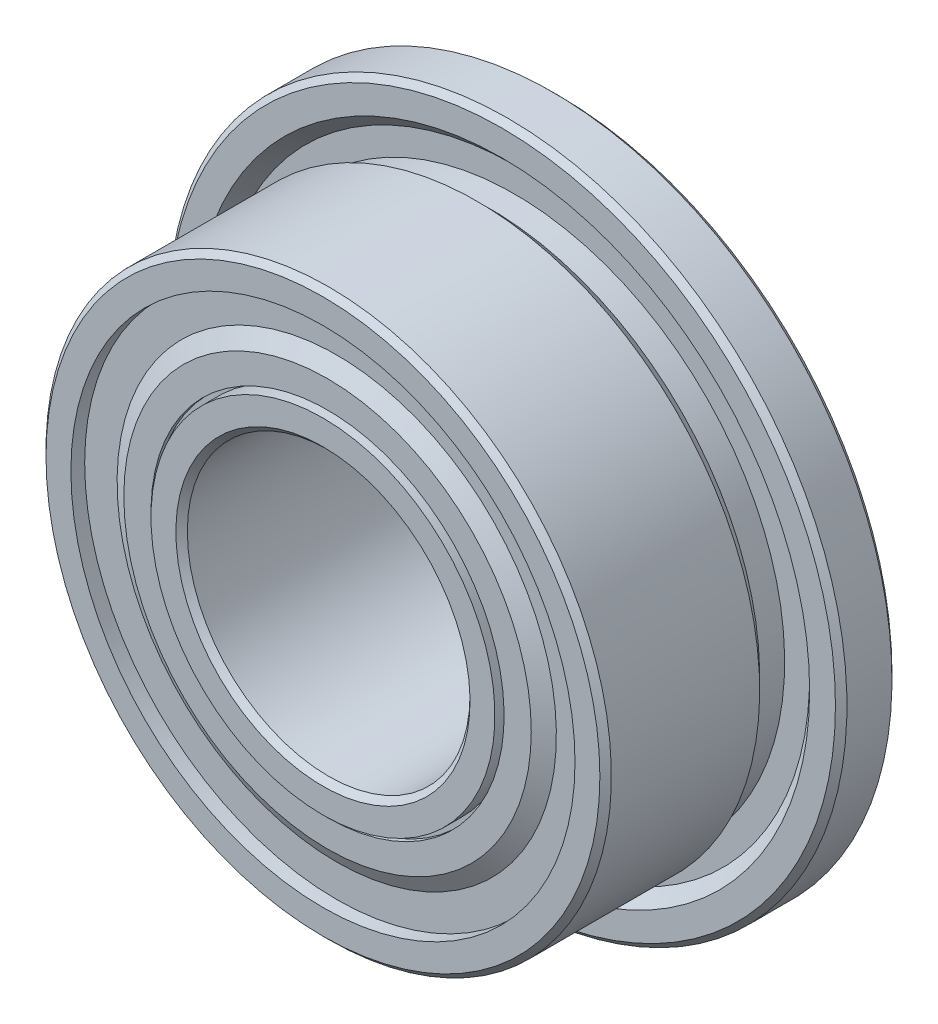
ISO-10303-21;
HEADER;
FILE_DESCRIPTION(('STEP AP214'),'2;1');
FILE_NAME('part.step','',(''),(''),'','','');
FILE_SCHEMA(('AUTOMOTIVE_DESIGN { 1 0 10303 214 1 1 1 1 }'));
ENDSEC;
DATA;
#1=APPLICATION_CONTEXT('core data for automotive mechanical design processes');
#2=APPLICATION_PROTOCOL_DEFINITION('international standard','automotive_design',2000,#1);
#3=PRODUCT_CONTEXT('',#1,'mechanical');
#4=PRODUCT('Part','Part','',(#3));
#5=PRODUCT_RELATED_PRODUCT_CATEGORY('part','',(#4));
#6=PRODUCT_DEFINITION_FORMATION('','',#4);
#7=PRODUCT_DEFINITION_CONTEXT('part definition',#1,'design');
#8=PRODUCT_DEFINITION('design','',#6,#7);
#9=PRODUCT_DEFINITION_SHAPE('','',#8);
#10=(LENGTH_UNIT() NAMED_UNIT(*) SI_UNIT(.MILLI.,.METRE.));
#11=(NAMED_UNIT(*) PLANE_ANGLE_UNIT() SI_UNIT($,.RADIAN.));
#12=(NAMED_UNIT(*) SI_UNIT($,.STERADIAN.) SOLID_ANGLE_UNIT());
#13=UNCERTAINTY_MEASURE_WITH_UNIT(LENGTH_MEASURE(1.E-05),#10,'distance_accuracy_value','');
#14=(GEOMETRIC_REPRESENTATION_CONTEXT(3) GLOBAL_UNCERTAINTY_ASSIGNED_CONTEXT((#13)) GLOBAL_UNIT_ASSIGNED_CONTEXT((#10,
#11,#12)) REPRESENTATION_CONTEXT('',''));
#15=CARTESIAN_POINT('',(0.,0.,0.));
#16=DIRECTION('',(0.,0.,1.));
#17=DIRECTION('',(1.,0.,0.));
#18=AXIS2_PLACEMENT_3D('',#15,#16,#17);
#19=CARTESIAN_POINT('',(0.,0.,0.));
#20=DIRECTION('',(0.,0.,1.));
#21=DIRECTION('',(0.,-1.,0.));
#22=AXIS2_PLACEMENT_3D('',#19,#20,#21);
#23=CYLINDRICAL_SURFACE('',#22,2.675);
#24=CARTESIAN_POINT('',(0.,0.,-1.055));
#25=DIRECTION('',(0.,0.,1.));
#26=DIRECTION('',(0.,-1.,0.));
#27=AXIS2_PLACEMENT_3D('',#24,#25,#26);
#28=CIRCLE('',#27,2.675);
#29=CARTESIAN_POINT('',(0.,-2.675,-1.055));
#30=VERTEX_POINT('',#29);
#31=EDGE_CURVE('E78',#30,#30,#28,.T.);
#32=ORIENTED_EDGE('',*,*,#31,.F.);
#33=EDGE_LOOP('',(#32));
#34=FACE_BOUND('',#33,.T.);
#35=CARTESIAN_POINT('',(0.,0.,-1.10375));
#36=DIRECTION('',(0.,0.,1.));
#37=DIRECTION('',(0.,-1.,0.));
#38=AXIS2_PLACEMENT_3D('',#35,#36,#37);
#39=CIRCLE('',#38,2.675);
#40=CARTESIAN_POINT('',(0.,-2.675,-1.10375));
#41=VERTEX_POINT('',#40);
#42=EDGE_CURVE('E12',#41,#41,#39,.T.);
#43=ORIENTED_EDGE('',*,*,#42,.T.);
#44=EDGE_LOOP('',(#43));
#45=FACE_BOUND('',#44,.T.);
#46=ADVANCED_FACE('F50',(#34,#45),#23,.T.);
#47=CARTESIAN_POINT('',(0.,2.675,-1.10375));
#48=DIRECTION('',(0.,0.,1.));
#49=DIRECTION('',(0.,-1.,0.));
#50=AXIS2_PLACEMENT_3D('',#47,#48,#49);
#51=PLANE('',#50);
#52=ORIENTED_EDGE('',*,*,#42,.F.);
#53=EDGE_LOOP('',(#52));
#54=FACE_BOUND('',#53,.T.);
#55=CARTESIAN_POINT('',(0.,0.,-1.10375));
#56=DIRECTION('',(0.,0.,1.));
#57=DIRECTION('',(0.,-1.,0.));
#58=AXIS2_PLACEMENT_3D('',#55,#56,#57);
#59=CIRCLE('',#58,2.33091966598816);
#60=CARTESIAN_POINT('',(0.,-2.33091966598816,-1.10375));
#61=VERTEX_POINT('',#60);
#62=EDGE_CURVE('E56',#61,#61,#59,.T.);
#63=ORIENTED_EDGE('',*,*,#62,.T.);
#64=EDGE_LOOP('',(#63));
#65=FACE_BOUND('',#64,.T.);
#66=ADVANCED_FACE('F85',(#54,#65),#51,.F.);
#67=CARTESIAN_POINT('',(0.,0.,-1.20125));
#68=DIRECTION('',(0.,0.,1.));
#69=DIRECTION('',(0.,-1.,0.));
#70=AXIS2_PLACEMENT_3D('',#67,#68,#69);
#71=CONICAL_SURFACE('',#70,2.1620447122502,1.0471975511966);
#72=ORIENTED_EDGE('',*,*,#62,.F.);
#73=EDGE_LOOP('',(#72));
#74=FACE_BOUND('',#73,.T.);
#75=CARTESIAN_POINT('',(0.,0.,-1.20125));
#76=DIRECTION('',(0.,0.,1.));
#77=DIRECTION('',(0.,-1.,0.));
#78=AXIS2_PLACEMENT_3D('',#75,#76,#77);
#79=CIRCLE('',#78,2.1620447122502);
#80=CARTESIAN_POINT('',(0.,-2.1620447122502,-1.20125));
#81=VERTEX_POINT('',#80);
#82=EDGE_CURVE('E60',#81,#81,#79,.T.);
#83=ORIENTED_EDGE('',*,*,#82,.T.);
#84=EDGE_LOOP('',(#83));
#85=FACE_BOUND('',#84,.T.);
#86=ADVANCED_FACE('F89',(#74,#85),#71,.T.);
#87=CARTESIAN_POINT('',(0.,2.1620447122502,-1.20125));
#88=DIRECTION('',(0.,0.,1.));
#89=DIRECTION('',(0.,-1.,0.));
#90=AXIS2_PLACEMENT_3D('',#87,#88,#89);
#91=PLANE('',#90);
#92=ORIENTED_EDGE('',*,*,#82,.F.);
#93=EDGE_LOOP('',(#92));
#94=FACE_BOUND('',#93,.T.);
#95=CARTESIAN_POINT('',(0.,0.,-1.20125));
#96=DIRECTION('',(0.,0.,1.));
#97=DIRECTION('',(0.,-1.,0.));
#98=AXIS2_PLACEMENT_3D('',#95,#96,#97);
#99=CIRCLE('',#98,1.87375);
#100=CARTESIAN_POINT('',(0.,-1.87375,-1.20125));
#101=VERTEX_POINT('',#100);
#102=EDGE_CURVE('E64',#101,#101,#99,.T.);
#103=ORIENTED_EDGE('',*,*,#102,.T.);
#104=EDGE_LOOP('',(#103));
#105=FACE_BOUND('',#104,.T.);
#106=ADVANCED_FACE('F94',(#94,#105),#91,.F.);
#107=CARTESIAN_POINT('',(0.,0.,0.));
#108=DIRECTION('',(0.,0.,1.));
#109=DIRECTION('',(0.,-1.,0.));
#110=AXIS2_PLACEMENT_3D('',#107,#108,#109);
#111=CYLINDRICAL_SURFACE('',#110,1.87375);
#112=ORIENTED_EDGE('',*,*,#102,.F.);
#113=EDGE_LOOP('',(#112));
#114=FACE_BOUND('',#113,.T.);
#115=CARTESIAN_POINT('',(0.,0.,-1.1525));
#116=DIRECTION('',(0.,0.,1.));
#117=DIRECTION('',(0.,-1.,0.));
#118=AXIS2_PLACEMENT_3D('',#115,#116,#117);
#119=CIRCLE('',#118,1.87375);
#120=CARTESIAN_POINT('',(0.,-1.87375,-1.1525));
#121=VERTEX_POINT('',#120);
#122=EDGE_CURVE('E69',#121,#121,#119,.T.);
#123=ORIENTED_EDGE('',*,*,#122,.T.);
#124=EDGE_LOOP('',(#123));
#125=FACE_BOUND('',#124,.T.);
#126=ADVANCED_FACE('F100',(#114,#125),#111,.F.);
#127=CARTESIAN_POINT('',(0.,2.14898218911918,-1.1525));
#128=DIRECTION('',(0.,0.,-1.));
#129=DIRECTION('',(0.,1.,0.));
#130=AXIS2_PLACEMENT_3D('',#127,#128,#129);
#131=PLANE('',#130);
#132=ORIENTED_EDGE('',*,*,#122,.F.);
#133=EDGE_LOOP('',(#132));
#134=FACE_BOUND('',#133,.T.);
#135=CARTESIAN_POINT('',(0.,0.,-1.1525));
#136=DIRECTION('',(0.,0.,1.));
#137=DIRECTION('',(0.,-1.,0.));
#138=AXIS2_PLACEMENT_3D('',#135,#136,#137);
#139=CIRCLE('',#138,2.14898218911918);
#140=CARTESIAN_POINT('',(0.,-2.14898218911918,-1.1525));
#141=VERTEX_POINT('',#140);
#142=EDGE_CURVE('E72',#141,#141,#139,.T.);
#143=ORIENTED_EDGE('',*,*,#142,.T.);
#144=EDGE_LOOP('',(#143));
#145=FACE_BOUND('',#144,.T.);
#146=ADVANCED_FACE('F104',(#134,#145),#131,.F.);
#147=CARTESIAN_POINT('',(0.,0.,-1.055));
#148=DIRECTION('',(0.,0.,1.));
#149=DIRECTION('',(0.,-1.,0.));
#150=AXIS2_PLACEMENT_3D('',#147,#148,#149);
#151=CONICAL_SURFACE('',#150,2.31785714285714,1.0471975511966);
#152=ORIENTED_EDGE('',*,*,#142,.F.);
#153=EDGE_LOOP('',(#152));
#154=FACE_BOUND('',#153,.T.);
#155=CARTESIAN_POINT('',(0.,0.,-1.055));
#156=DIRECTION('',(0.,0.,1.));
#157=DIRECTION('',(0.,-1.,0.));
#158=AXIS2_PLACEMENT_3D('',#155,#156,#157);
#159=CIRCLE('',#158,2.31785714285714);
#160=CARTESIAN_POINT('',(0.,-2.31785714285714,-1.055));
#161=VERTEX_POINT('',#160);
#162=EDGE_CURVE('E75',#161,#161,#159,.T.);
#163=ORIENTED_EDGE('',*,*,#162,.T.);
#164=EDGE_LOOP('',(#163));
#165=FACE_BOUND('',#164,.T.);
#166=ADVANCED_FACE('F108',(#154,#165),#151,.F.);
#167=CARTESIAN_POINT('',(0.,2.675,-1.055));
#168=DIRECTION('',(0.,0.,-1.));
#169=DIRECTION('',(0.,1.,0.));
#170=AXIS2_PLACEMENT_3D('',#167,#168,#169);
#171=PLANE('',#170);
#172=ORIENTED_EDGE('',*,*,#162,.F.);
#173=EDGE_LOOP('',(#172));
#174=FACE_BOUND('',#173,.T.);
#175=ORIENTED_EDGE('',*,*,#31,.T.);
#176=EDGE_LOOP('',(#175));
#177=FACE_BOUND('',#176,.T.);
#178=ADVANCED_FACE('F82',(#174,#177),#171,.F.);
#179=CLOSED_SHELL('',(#46,#66,#86,#106,#126,#146,#166,#178));
#180=MANIFOLD_SOLID_BREP('B2',#179);
#181=CARTESIAN_POINT('',(0.,0.,0.));
#182=DIRECTION('',(0.,0.,1.));
#183=DIRECTION('',(0.,-1.,0.));
#184=AXIS2_PLACEMENT_3D('',#181,#182,#183);
#185=CYLINDRICAL_SURFACE('',#184,2.675);
#186=CARTESIAN_POINT('',(0.,0.,1.10375));
#187=DIRECTION('',(0.,0.,1.));
#188=DIRECTION('',(0.,-1.,0.));
#189=AXIS2_PLACEMENT_3D('',#186,#187,#188);
#190=CIRCLE('',#189,2.675);
#191=CARTESIAN_POINT('',(0.,-2.675,1.10375));
#192=VERTEX_POINT('',#191);
#193=EDGE_CURVE('E49',#192,#192,#190,.T.);
#194=ORIENTED_EDGE('',*,*,#193,.F.);
#195=EDGE_LOOP('',(#194));
#196=FACE_BOUND('',#195,.T.);
#197=CARTESIAN_POINT('',(0.,0.,1.055));
#198=DIRECTION('',(0.,0.,1.));
#199=DIRECTION('',(0.,-1.,0.));
#200=AXIS2_PLACEMENT_3D('',#197,#198,#199);
#201=CIRCLE('',#200,2.675);
#202=CARTESIAN_POINT('',(0.,-2.675,1.055));
#203=VERTEX_POINT('',#202);
#204=EDGE_CURVE('E206',#203,#203,#201,.T.);
#205=ORIENTED_EDGE('',*,*,#204,.T.);
#206=EDGE_LOOP('',(#205));
#207=FACE_BOUND('',#206,.T.);
#208=ADVANCED_FACE('F178',(#196,#207),#185,.T.);
#209=CARTESIAN_POINT('',(0.,2.675,1.10375));
#210=DIRECTION('',(0.,0.,-1.));
#211=DIRECTION('',(0.,1.,0.));
#212=AXIS2_PLACEMENT_3D('',#209,#210,#211);
#213=PLANE('',#212);
#214=CARTESIAN_POINT('',(0.,0.,1.10375));
#215=DIRECTION('',(0.,0.,1.));
#216=DIRECTION('',(0.,-1.,0.));
#217=AXIS2_PLACEMENT_3D('',#214,#215,#216);
#218=CIRCLE('',#217,2.33091966598816);
#219=CARTESIAN_POINT('',(0.,-2.33091966598816,1.10375));
#220=VERTEX_POINT('',#219);
#221=EDGE_CURVE('E184',#220,#220,#218,.T.);
#222=ORIENTED_EDGE('',*,*,#221,.F.);
#223=EDGE_LOOP('',(#222));
#224=FACE_BOUND('',#223,.T.);
#225=ORIENTED_EDGE('',*,*,#193,.T.);
#226=EDGE_LOOP('',(#225));
#227=FACE_BOUND('',#226,.T.);
#228=ADVANCED_FACE('F243',(#224,#227),#213,.F.);
#229=CARTESIAN_POINT('',(0.,0.,1.10375));
#230=DIRECTION('',(0.,0.,-1.));
#231=DIRECTION('',(0.,1.,0.));
#232=AXIS2_PLACEMENT_3D('',#229,#230,#231);
#233=CONICAL_SURFACE('',#232,2.33091966598816,1.0471975511966);
#234=CARTESIAN_POINT('',(0.,0.,1.20125));
#235=DIRECTION('',(0.,0.,1.));
#236=DIRECTION('',(0.,-1.,0.));
#237=AXIS2_PLACEMENT_3D('',#234,#235,#236);
#238=CIRCLE('',#237,2.1620447122502);
#239=CARTESIAN_POINT('',(0.,-2.1620447122502,1.20125));
#240=VERTEX_POINT('',#239);
#241=EDGE_CURVE('E188',#240,#240,#238,.T.);
#242=ORIENTED_EDGE('',*,*,#241,.F.);
#243=EDGE_LOOP('',(#242));
#244=FACE_BOUND('',#243,.T.);
#245=ORIENTED_EDGE('',*,*,#221,.T.);
#246=EDGE_LOOP('',(#245));
#247=FACE_BOUND('',#246,.T.);
#248=ADVANCED_FACE('F238',(#244,#247),#233,.T.);
#249=CARTESIAN_POINT('',(0.,2.1620447122502,1.20125));
#250=DIRECTION('',(0.,0.,-1.));
#251=DIRECTION('',(0.,1.,0.));
#252=AXIS2_PLACEMENT_3D('',#249,#250,#251);
#253=PLANE('',#252);
#254=CARTESIAN_POINT('',(0.,0.,1.20125));
#255=DIRECTION('',(0.,0.,1.));
#256=DIRECTION('',(0.,-1.,0.));
#257=AXIS2_PLACEMENT_3D('',#254,#255,#256);
#258=CIRCLE('',#257,1.87375);
#259=CARTESIAN_POINT('',(0.,-1.87375,1.20125));
#260=VERTEX_POINT('',#259);
#261=EDGE_CURVE('E192',#260,#260,#258,.T.);
#262=ORIENTED_EDGE('',*,*,#261,.F.);
#263=EDGE_LOOP('',(#262));
#264=FACE_BOUND('',#263,.T.);
#265=ORIENTED_EDGE('',*,*,#241,.T.);
#266=EDGE_LOOP('',(#265));
#267=FACE_BOUND('',#266,.T.);
#268=ADVANCED_FACE('F232',(#264,#267),#253,.F.);
#269=CARTESIAN_POINT('',(0.,0.,0.));
#270=DIRECTION('',(0.,0.,1.));
#271=DIRECTION('',(0.,-1.,0.));
#272=AXIS2_PLACEMENT_3D('',#269,#270,#271);
#273=CYLINDRICAL_SURFACE('',#272,1.87375);
#274=CARTESIAN_POINT('',(0.,0.,1.1525));
#275=DIRECTION('',(0.,0.,1.));
#276=DIRECTION('',(0.,-1.,0.));
#277=AXIS2_PLACEMENT_3D('',#274,#275,#276);
#278=CIRCLE('',#277,1.87375);
#279=CARTESIAN_POINT('',(0.,-1.87375,1.1525));
#280=VERTEX_POINT('',#279);
#281=EDGE_CURVE('E197',#280,#280,#278,.T.);
#282=ORIENTED_EDGE('',*,*,#281,.F.);
#283=EDGE_LOOP('',(#282));
#284=FACE_BOUND('',#283,.T.);
#285=ORIENTED_EDGE('',*,*,#261,.T.);
#286=EDGE_LOOP('',(#285));
#287=FACE_BOUND('',#286,.T.);
#288=ADVANCED_FACE('F226',(#284,#287),#273,.F.);
#289=CARTESIAN_POINT('',(0.,2.14898218911918,1.1525));
#290=DIRECTION('',(0.,0.,1.));
#291=DIRECTION('',(0.,-1.,0.));
#292=AXIS2_PLACEMENT_3D('',#289,#290,#291);
#293=PLANE('',#292);
#294=CARTESIAN_POINT('',(0.,0.,1.1525));
#295=DIRECTION('',(0.,0.,1.));
#296=DIRECTION('',(0.,-1.,0.));
#297=AXIS2_PLACEMENT_3D('',#294,#295,#296);
#298=CIRCLE('',#297,2.14898218911918);
#299=CARTESIAN_POINT('',(0.,-2.14898218911918,1.1525));
#300=VERTEX_POINT('',#299);
#301=EDGE_CURVE('E200',#300,#300,#298,.T.);
#302=ORIENTED_EDGE('',*,*,#301,.F.);
#303=EDGE_LOOP('',(#302));
#304=FACE_BOUND('',#303,.T.);
#305=ORIENTED_EDGE('',*,*,#281,.T.);
#306=EDGE_LOOP('',(#305));
#307=FACE_BOUND('',#306,.T.);
#308=ADVANCED_FACE('F220',(#304,#307),#293,.F.);
#309=CARTESIAN_POINT('',(0.,0.,1.1525));
#310=DIRECTION('',(0.,0.,-1.));
#311=DIRECTION('',(0.,1.,0.));
#312=AXIS2_PLACEMENT_3D('',#309,#310,#311);
#313=CONICAL_SURFACE('',#312,2.14898218911918,1.0471975511966);
#314=CARTESIAN_POINT('',(0.,0.,1.055));
#315=DIRECTION('',(0.,0.,1.));
#316=DIRECTION('',(0.,-1.,0.));
#317=AXIS2_PLACEMENT_3D('',#314,#315,#316);
#318=CIRCLE('',#317,2.31785714285714);
#319=CARTESIAN_POINT('',(0.,-2.31785714285714,1.055));
#320=VERTEX_POINT('',#319);
#321=EDGE_CURVE('E203',#320,#320,#318,.T.);
#322=ORIENTED_EDGE('',*,*,#321,.F.);
#323=EDGE_LOOP('',(#322));
#324=FACE_BOUND('',#323,.T.);
#325=ORIENTED_EDGE('',*,*,#301,.T.);
#326=EDGE_LOOP('',(#325));
#327=FACE_BOUND('',#326,.T.);
#328=ADVANCED_FACE('F214',(#324,#327),#313,.F.);
#329=CARTESIAN_POINT('',(0.,2.675,1.055));
#330=DIRECTION('',(0.,0.,1.));
#331=DIRECTION('',(0.,-1.,0.));
#332=AXIS2_PLACEMENT_3D('',#329,#330,#331);
#333=PLANE('',#332);
#334=ORIENTED_EDGE('',*,*,#204,.F.);
#335=EDGE_LOOP('',(#334));
#336=FACE_BOUND('',#335,.T.);
#337=ORIENTED_EDGE('',*,*,#321,.T.);
#338=EDGE_LOOP('',(#337));
#339=FACE_BOUND('',#338,.T.);
#340=ADVANCED_FACE('F211',(#336,#339),#333,.F.);
#341=CLOSED_SHELL('',(#208,#228,#248,#268,#288,#308,#328,#340));
#342=MANIFOLD_SOLID_BREP('B7',#341);
#343=CARTESIAN_POINT('',(-0.976238413014479,2.02717995278046,0.));
#344=DIRECTION('',(-0.433883739117546,0.900968867902425,0.));
#345=DIRECTION('',(0.900968867902425,0.433883739117546,0.));
#346=AXIS2_PLACEMENT_3D('',#343,#344,#345);
#347=SPHERICAL_SURFACE('',#346,0.4);
#348=CARTESIAN_POINT('',(-1.1497919086615,2.38756749994143,0.));
#349=VERTEX_POINT('',#348);
#350=VERTEX_LOOP('',#349);
#351=FACE_BOUND('',#350,.T.);
#352=ADVANCED_FACE('F306',(#351),#347,.T.);
#353=CLOSED_SHELL('',(#352));
#354=MANIFOLD_SOLID_BREP('B44',#353);
#355=CARTESIAN_POINT('',(-1.75912083555305,1.40285205418217,0.));
#356=DIRECTION('',(-0.781831482468022,0.623489801858743,0.));
#357=DIRECTION('',(0.623489801858743,0.781831482468022,0.));
#358=AXIS2_PLACEMENT_3D('',#355,#356,#357);
#359=SPHERICAL_SURFACE('',#358,0.4);
#360=CARTESIAN_POINT('',(-2.07185342854026,1.65224797492567,0.));
#361=VERTEX_POINT('',#360);
#362=VERTEX_LOOP('',#361);
#363=FACE_BOUND('',#362,.T.);
#364=ADVANCED_FACE('F325',(#363),#359,.T.);
#365=CLOSED_SHELL('',(#364));
#366=MANIFOLD_SOLID_BREP('B174',#365);
#367=CARTESIAN_POINT('',(-2.1935878024091,0.50067210140173,0.));
#368=DIRECTION('',(-0.974927912181821,0.222520933956325,0.));
#369=DIRECTION('',(0.222520933956325,0.974927912181821,0.));
#370=AXIS2_PLACEMENT_3D('',#367,#368,#369);
#371=SPHERICAL_SURFACE('',#370,0.4);
#372=CARTESIAN_POINT('',(-2.58355896728183,0.58968047498426,0.));
#373=VERTEX_POINT('',#372);
#374=VERTEX_LOOP('',#373);
#375=FACE_BOUND('',#374,.T.);
#376=ADVANCED_FACE('F344',(#375),#371,.T.);
#377=CLOSED_SHELL('',(#376));
#378=MANIFOLD_SOLID_BREP('B302',#377);
#379=CARTESIAN_POINT('',(-2.19358780240911,-0.500672101401686,0.));
#380=DIRECTION('',(-0.974927912181826,-0.222520933956305,0.));
#381=DIRECTION('',(-0.222520933956305,0.974927912181826,0.));
#382=AXIS2_PLACEMENT_3D('',#379,#380,#381);
#383=SPHERICAL_SURFACE('',#382,0.4);
#384=CARTESIAN_POINT('',(-2.58355896728184,-0.589680474984208,0.));
#385=VERTEX_POINT('',#384);
#386=VERTEX_LOOP('',#385);
#387=FACE_BOUND('',#386,.T.);
#388=ADVANCED_FACE('F363',(#387),#383,.T.);
#389=CLOSED_SHELL('',(#388));
#390=MANIFOLD_SOLID_BREP('B321',#389);
#391=CARTESIAN_POINT('',(-1.75912083555308,-1.40285205418214,0.));
#392=DIRECTION('',(-0.781831482468035,-0.623489801858727,0.));
#393=DIRECTION('',(-0.623489801858727,0.781831482468035,0.));
#394=AXIS2_PLACEMENT_3D('',#391,#392,#393);
#395=SPHERICAL_SURFACE('',#394,0.4);
#396=CARTESIAN_POINT('',(-2.07185342854029,-1.65224797492563,0.));
#397=VERTEX_POINT('',#396);
#398=VERTEX_LOOP('',#397);
#399=FACE_BOUND('',#398,.T.);
#400=ADVANCED_FACE('F382',(#399),#395,.T.);
#401=CLOSED_SHELL('',(#400));
#402=MANIFOLD_SOLID_BREP('B340',#401);
#403=CARTESIAN_POINT('',(-0.976238413014522,-2.02717995278044,0.));
#404=DIRECTION('',(-0.433883739117565,-0.900968867902416,0.));
#405=DIRECTION('',(-0.900968867902416,0.433883739117565,0.));
#406=AXIS2_PLACEMENT_3D('',#403,#404,#405);
#407=SPHERICAL_SURFACE('',#406,0.4);
#408=CARTESIAN_POINT('',(-1.14979190866155,-2.3875674999414,0.));
#409=VERTEX_POINT('',#408);
#410=VERTEX_LOOP('',#409);
#411=FACE_BOUND('',#410,.T.);
#412=ADVANCED_FACE('F401',(#411),#407,.T.);
#413=CLOSED_SHELL('',(#412));
#414=MANIFOLD_SOLID_BREP('B359',#413);
#415=CARTESIAN_POINT('',(0.,-2.25,0.));
#416=DIRECTION('',(0.,-1.,0.));
#417=DIRECTION('',(-1.,0.,0.));
#418=AXIS2_PLACEMENT_3D('',#415,#416,#417);
#419=SPHERICAL_SURFACE('',#418,0.4);
#420=CARTESIAN_POINT('',(0.,-2.65,0.));
#421=VERTEX_POINT('',#420);
#422=VERTEX_LOOP('',#421);
#423=FACE_BOUND('',#422,.T.);
#424=ADVANCED_FACE('F420',(#423),#419,.T.);
#425=CLOSED_SHELL('',(#424));
#426=MANIFOLD_SOLID_BREP('B378',#425);
#427=CARTESIAN_POINT('',(0.976238413014494,-2.02717995278045,0.));
#428=DIRECTION('',(0.433883739117553,-0.900968867902422,0.));
#429=DIRECTION('',(-0.900968867902422,-0.433883739117553,0.));
#430=AXIS2_PLACEMENT_3D('',#427,#428,#429);
#431=SPHERICAL_SURFACE('',#430,0.4);
#432=CARTESIAN_POINT('',(1.14979190866151,-2.38756749994142,0.));
#433=VERTEX_POINT('',#432);
#434=VERTEX_LOOP('',#433);
#435=FACE_BOUND('',#434,.T.);
#436=ADVANCED_FACE('F439',(#435),#431,.T.);
#437=CLOSED_SHELL('',(#436));
#438=MANIFOLD_SOLID_BREP('B397',#437);
#439=CARTESIAN_POINT('',(1.75912083555306,-1.40285205418216,0.));
#440=DIRECTION('',(0.781831482468027,-0.623489801858737,0.));
#441=DIRECTION('',(-0.623489801858737,-0.781831482468027,0.));
#442=AXIS2_PLACEMENT_3D('',#439,#440,#441);
#443=SPHERICAL_SURFACE('',#442,0.4);
#444=CARTESIAN_POINT('',(2.07185342854027,-1.65224797492565,0.));
#445=VERTEX_POINT('',#444);
#446=VERTEX_LOOP('',#445);
#447=FACE_BOUND('',#446,.T.);
#448=ADVANCED_FACE('F458',(#447),#443,.T.);
#449=CLOSED_SHELL('',(#448));
#450=MANIFOLD_SOLID_BREP('B416',#449);
#451=CARTESIAN_POINT('',(2.1935878024091,-0.500672101401716,0.));
#452=DIRECTION('',(0.974927912181823,-0.222520933956318,0.));
#453=DIRECTION('',(-0.222520933956318,-0.974927912181823,0.));
#454=AXIS2_PLACEMENT_3D('',#451,#452,#453);
#455=SPHERICAL_SURFACE('',#454,0.4);
#456=CARTESIAN_POINT('',(2.58355896728183,-0.589680474984243,0.));
#457=VERTEX_POINT('',#456);
#458=VERTEX_LOOP('',#457);
#459=FACE_BOUND('',#458,.T.);
#460=ADVANCED_FACE('F477',(#459),#455,.T.);
#461=CLOSED_SHELL('',(#460));
#462=MANIFOLD_SOLID_BREP('B435',#461);
#463=CARTESIAN_POINT('',(2.1935878024091,0.500672101401701,0.));
#464=DIRECTION('',(0.974927912181824,0.222520933956311,0.));
#465=DIRECTION('',(0.222520933956311,-0.974927912181824,0.));
#466=AXIS2_PLACEMENT_3D('',#463,#464,#465);
#467=SPHERICAL_SURFACE('',#466,0.4);
#468=CARTESIAN_POINT('',(2.58355896728183,0.589680474984225,0.));
#469=VERTEX_POINT('',#468);
#470=VERTEX_LOOP('',#469);
#471=FACE_BOUND('',#470,.T.);
#472=ADVANCED_FACE('F496',(#471),#467,.T.);
#473=CLOSED_SHELL('',(#472));
#474=MANIFOLD_SOLID_BREP('B454',#473);
#475=CARTESIAN_POINT('',(1.75912083555307,1.40285205418215,0.));
#476=DIRECTION('',(0.781831482468031,0.623489801858732,0.));
#477=DIRECTION('',(0.623489801858732,-0.781831482468031,0.));
#478=AXIS2_PLACEMENT_3D('',#475,#476,#477);
#479=SPHERICAL_SURFACE('',#478,0.4);
#480=CARTESIAN_POINT('',(2.07185342854028,1.65224797492564,0.));
#481=VERTEX_POINT('',#480);
#482=VERTEX_LOOP('',#481);
#483=FACE_BOUND('',#482,.T.);
#484=ADVANCED_FACE('F515',(#483),#479,.T.);
#485=CLOSED_SHELL('',(#484));
#486=MANIFOLD_SOLID_BREP('B473',#485);
#487=CARTESIAN_POINT('',(0.976238413014508,2.02717995278044,0.));
#488=DIRECTION('',(0.433883739117559,0.900968867902419,0.));
#489=DIRECTION('',(0.900968867902419,-0.433883739117559,0.));
#490=AXIS2_PLACEMENT_3D('',#487,#488,#489);
#491=SPHERICAL_SURFACE('',#490,0.4);
#492=CARTESIAN_POINT('',(1.14979190866153,2.38756749994141,0.));
#493=VERTEX_POINT('',#492);
#494=VERTEX_LOOP('',#493);
#495=FACE_BOUND('',#494,.T.);
#496=ADVANCED_FACE('F534',(#495),#491,.T.);
#497=CLOSED_SHELL('',(#496));
#498=MANIFOLD_SOLID_BREP('B492',#497);
#499=CARTESIAN_POINT('',(0.,2.25,0.));
#500=DIRECTION('',(0.,1.,0.));
#501=DIRECTION('',(1.,0.,0.));
#502=AXIS2_PLACEMENT_3D('',#499,#500,#501);
#503=SPHERICAL_SURFACE('',#502,0.4);
#504=CARTESIAN_POINT('',(0.,2.65,0.));
#505=VERTEX_POINT('',#504);
#506=VERTEX_LOOP('',#505);
#507=FACE_BOUND('',#506,.T.);
#508=ADVANCED_FACE('F556',(#507),#503,.T.);
#509=CLOSED_SHELL('',(#508));
#510=MANIFOLD_SOLID_BREP('B511',#509);
#511=CARTESIAN_POINT('',(0.,0.,0.));
#512=DIRECTION('',(0.,0.,1.));
#513=DIRECTION('',(0.,-1.,0.));
#514=AXIS2_PLACEMENT_3D('',#511,#512,#513);
#515=CYLINDRICAL_SURFACE('',#514,1.9875);
#516=CARTESIAN_POINT('',(0.,0.,0.301817411691241));
#517=DIRECTION('',(0.,0.,1.));
#518=DIRECTION('',(0.,-1.,0.));
#519=AXIS2_PLACEMENT_3D('',#516,#517,#518);
#520=CIRCLE('',#519,1.9875);
#521=CARTESIAN_POINT('',(0.,-1.9875,0.30181741169124));
#522=VERTEX_POINT('',#521);
#523=EDGE_CURVE('E601',#522,#522,#520,.T.);
#524=ORIENTED_EDGE('',*,*,#523,.T.);
#525=EDGE_LOOP('',(#524));
#526=FACE_BOUND('',#525,.T.);
#527=CARTESIAN_POINT('',(0.,0.,1.055));
#528=DIRECTION('',(0.,0.,1.));
#529=DIRECTION('',(0.,-1.,0.));
#530=AXIS2_PLACEMENT_3D('',#527,#528,#529);
#531=CIRCLE('',#530,1.9875);
#532=CARTESIAN_POINT('',(0.,-1.9875,1.055));
#533=VERTEX_POINT('',#532);
#534=EDGE_CURVE('E619',#533,#533,#531,.T.);
#535=ORIENTED_EDGE('',*,*,#534,.F.);
#536=EDGE_LOOP('',(#535));
#537=FACE_BOUND('',#536,.T.);
#538=ADVANCED_FACE('F578',(#526,#537),#515,.T.);
#539=CARTESIAN_POINT('',(0.,1.5,1.25));
#540=DIRECTION('',(0.,0.,-1.));
#541=DIRECTION('',(0.,1.,0.));
#542=AXIS2_PLACEMENT_3D('',#539,#540,#541);
#543=PLANE('',#542);
#544=CARTESIAN_POINT('',(0.,0.,1.25));
#545=DIRECTION('',(0.,0.,-1.));
#546=DIRECTION('',(0.,1.,0.));
#547=AXIS2_PLACEMENT_3D('',#544,#545,#546);
#548=CIRCLE('',#547,1.5609375);
#549=CARTESIAN_POINT('',(0.,1.5609375,1.25));
#550=VERTEX_POINT('',#549);
#551=EDGE_CURVE('E555',#550,#550,#548,.T.);
#552=ORIENTED_EDGE('',*,*,#551,.T.);
#553=EDGE_LOOP('',(#552));
#554=FACE_BOUND('',#553,.T.);
#555=CARTESIAN_POINT('',(0.,0.,1.25));
#556=DIRECTION('',(0.,0.,1.));
#557=DIRECTION('',(0.,-1.,0.));
#558=AXIS2_PLACEMENT_3D('',#555,#556,#557);
#559=CIRCLE('',#558,1.825);
#560=CARTESIAN_POINT('',(0.,-1.825,1.25));
#561=VERTEX_POINT('',#560);
#562=EDGE_CURVE('E613',#561,#561,#559,.T.);
#563=ORIENTED_EDGE('',*,*,#562,.T.);
#564=EDGE_LOOP('',(#563));
#565=FACE_BOUND('',#564,.T.);
#566=ADVANCED_FACE('F627',(#554,#565),#543,.F.);
#567=CARTESIAN_POINT('',(0.,0.,0.));
#568=DIRECTION('',(0.,0.,1.));
#569=DIRECTION('',(0.,-1.,0.));
#570=AXIS2_PLACEMENT_3D('',#567,#568,#569);
#571=CYLINDRICAL_SURFACE('',#570,1.9875);
#572=CARTESIAN_POINT('',(0.,0.,-0.301817411691241));
#573=DIRECTION('',(0.,0.,1.));
#574=DIRECTION('',(0.,-1.,0.));
#575=AXIS2_PLACEMENT_3D('',#572,#573,#574);
#576=CIRCLE('',#575,1.9875);
#577=CARTESIAN_POINT('',(0.,-1.9875,-0.301817411691241));
#578=VERTEX_POINT('',#577);
#579=EDGE_CURVE('E598',#578,#578,#576,.T.);
#580=ORIENTED_EDGE('',*,*,#579,.F.);
#581=EDGE_LOOP('',(#580));
#582=FACE_BOUND('',#581,.T.);
#583=CARTESIAN_POINT('',(0.,0.,-1.055));
#584=DIRECTION('',(0.,0.,1.));
#585=DIRECTION('',(0.,-1.,0.));
#586=AXIS2_PLACEMENT_3D('',#583,#584,#585);
#587=CIRCLE('',#586,1.9875);
#588=CARTESIAN_POINT('',(0.,-1.9875,-1.055));
#589=VERTEX_POINT('',#588);
#590=EDGE_CURVE('E610',#589,#589,#587,.T.);
#591=ORIENTED_EDGE('',*,*,#590,.T.);
#592=EDGE_LOOP('',(#591));
#593=FACE_BOUND('',#592,.T.);
#594=ADVANCED_FACE('F633',(#582,#593),#571,.T.);
#595=CARTESIAN_POINT('',(0.,1.9875,-1.25));
#596=DIRECTION('',(0.,0.,1.));
#597=DIRECTION('',(0.,-1.,0.));
#598=AXIS2_PLACEMENT_3D('',#595,#596,#597);
#599=PLANE('',#598);
#600=CARTESIAN_POINT('',(0.,0.,-1.25));
#601=DIRECTION('',(0.,0.,1.));
#602=DIRECTION('',(0.,-1.,0.));
#603=AXIS2_PLACEMENT_3D('',#600,#601,#602);
#604=CIRCLE('',#603,1.5609375);
#605=CARTESIAN_POINT('',(0.,-1.5609375,-1.25));
#606=VERTEX_POINT('',#605);
#607=EDGE_CURVE('E593',#606,#606,#604,.T.);
#608=ORIENTED_EDGE('',*,*,#607,.T.);
#609=EDGE_LOOP('',(#608));
#610=FACE_BOUND('',#609,.T.);
#611=CARTESIAN_POINT('',(0.,0.,-1.25));
#612=DIRECTION('',(0.,0.,1.));
#613=DIRECTION('',(0.,-1.,0.));
#614=AXIS2_PLACEMENT_3D('',#611,#612,#613);
#615=CIRCLE('',#614,1.825);
#616=CARTESIAN_POINT('',(0.,-1.825,-1.25));
#617=VERTEX_POINT('',#616);
#618=EDGE_CURVE('E604',#617,#617,#615,.T.);
#619=ORIENTED_EDGE('',*,*,#618,.F.);
#620=EDGE_LOOP('',(#619));
#621=FACE_BOUND('',#620,.T.);
#622=ADVANCED_FACE('F641',(#610,#621),#599,.F.);
#623=CARTESIAN_POINT('',(0.,0.,0.));
#624=DIRECTION('',(0.,0.,1.));
#625=DIRECTION('',(0.,-1.,0.));
#626=AXIS2_PLACEMENT_3D('',#623,#624,#625);
#627=TOROIDAL_SURFACE('',#626,2.25,0.4);
#628=ORIENTED_EDGE('',*,*,#523,.F.);
#629=EDGE_LOOP('',(#628));
#630=FACE_BOUND('',#629,.T.);
#631=ORIENTED_EDGE('',*,*,#579,.T.);
#632=EDGE_LOOP('',(#631));
#633=FACE_BOUND('',#632,.T.);
#634=ADVANCED_FACE('F637',(#630,#633),#627,.F.);
#635=CARTESIAN_POINT('',(0.,0.,0.));
#636=DIRECTION('',(0.,0.,1.));
#637=DIRECTION('',(0.,-1.,0.));
#638=AXIS2_PLACEMENT_3D('',#635,#636,#637);
#639=CYLINDRICAL_SURFACE('',#638,1.5);
#640=CARTESIAN_POINT('',(0.,0.,-1.1890625));
#641=DIRECTION('',(0.,0.,1.));
#642=DIRECTION('',(0.,-1.,0.));
#643=AXIS2_PLACEMENT_3D('',#640,#641,#642);
#644=CIRCLE('',#643,1.5);
#645=CARTESIAN_POINT('',(0.,-1.5,-1.1890625));
#646=VERTEX_POINT('',#645);
#647=EDGE_CURVE('E585',#646,#646,#644,.F.);
#648=ORIENTED_EDGE('',*,*,#647,.T.);
#649=EDGE_LOOP('',(#648));
#650=FACE_BOUND('',#649,.T.);
#651=CARTESIAN_POINT('',(0.,0.,1.1890625));
#652=DIRECTION('',(0.,0.,-1.));
#653=DIRECTION('',(0.,1.,0.));
#654=AXIS2_PLACEMENT_3D('',#651,#652,#653);
#655=CIRCLE('',#654,1.5);
#656=CARTESIAN_POINT('',(0.,1.5,1.1890625));
#657=VERTEX_POINT('',#656);
#658=EDGE_CURVE('E589',#657,#657,#655,.F.);
#659=ORIENTED_EDGE('',*,*,#658,.T.);
#660=EDGE_LOOP('',(#659));
#661=FACE_BOUND('',#660,.T.);
#662=ADVANCED_FACE('F640',(#650,#661),#639,.F.);
#663=CARTESIAN_POINT('',(0.,0.,-1.25));
#664=DIRECTION('',(0.,0.,-1.));
#665=DIRECTION('',(0.,1.,0.));
#666=AXIS2_PLACEMENT_3D('',#663,#664,#665);
#667=CONICAL_SURFACE('',#666,1.5609375,0.785398163397448);
#668=ORIENTED_EDGE('',*,*,#647,.F.);
#669=EDGE_LOOP('',(#668));
#670=FACE_BOUND('',#669,.T.);
#671=ORIENTED_EDGE('',*,*,#607,.F.);
#672=EDGE_LOOP('',(#671));
#673=FACE_BOUND('',#672,.T.);
#674=ADVANCED_FACE('F645',(#670,#673),#667,.F.);
#675=CARTESIAN_POINT('',(0.,0.,1.1890625));
#676=DIRECTION('',(0.,0.,1.));
#677=DIRECTION('',(0.,-1.,0.));
#678=AXIS2_PLACEMENT_3D('',#675,#676,#677);
#679=CONICAL_SURFACE('',#678,1.5,0.785398163397448);
#680=ORIENTED_EDGE('',*,*,#551,.F.);
#681=EDGE_LOOP('',(#680));
#682=FACE_BOUND('',#681,.T.);
#683=ORIENTED_EDGE('',*,*,#658,.F.);
#684=EDGE_LOOP('',(#683));
#685=FACE_BOUND('',#684,.T.);
#686=ADVANCED_FACE('F580',(#682,#685),#679,.F.);
#687=CARTESIAN_POINT('',(0.,0.,0.));
#688=DIRECTION('',(0.,0.,1.));
#689=DIRECTION('',(0.,-1.,0.));
#690=AXIS2_PLACEMENT_3D('',#687,#688,#689);
#691=CYLINDRICAL_SURFACE('',#690,1.825);
#692=ORIENTED_EDGE('',*,*,#618,.T.);
#693=EDGE_LOOP('',(#692));
#694=FACE_BOUND('',#693,.T.);
#695=CARTESIAN_POINT('',(0.,0.,-1.055));
#696=DIRECTION('',(0.,0.,1.));
#697=DIRECTION('',(0.,-1.,0.));
#698=AXIS2_PLACEMENT_3D('',#695,#696,#697);
#699=CIRCLE('',#698,1.825);
#700=CARTESIAN_POINT('',(0.,-1.825,-1.055));
#701=VERTEX_POINT('',#700);
#702=EDGE_CURVE('E607',#701,#701,#699,.T.);
#703=ORIENTED_EDGE('',*,*,#702,.F.);
#704=EDGE_LOOP('',(#703));
#705=FACE_BOUND('',#704,.T.);
#706=ADVANCED_FACE('F652',(#694,#705),#691,.T.);
#707=CARTESIAN_POINT('',(0.,1.9875,-1.055));
#708=DIRECTION('',(0.,0.,-1.));
#709=DIRECTION('',(0.,1.,0.));
#710=AXIS2_PLACEMENT_3D('',#707,#708,#709);
#711=PLANE('',#710);
#712=ORIENTED_EDGE('',*,*,#702,.T.);
#713=EDGE_LOOP('',(#712));
#714=FACE_BOUND('',#713,.T.);
#715=ORIENTED_EDGE('',*,*,#590,.F.);
#716=EDGE_LOOP('',(#715));
#717=FACE_BOUND('',#716,.T.);
#718=ADVANCED_FACE('F664',(#714,#717),#711,.T.);
#719=CARTESIAN_POINT('',(0.,0.,0.));
#720=DIRECTION('',(0.,0.,1.));
#721=DIRECTION('',(0.,-1.,0.));
#722=AXIS2_PLACEMENT_3D('',#719,#720,#721);
#723=CYLINDRICAL_SURFACE('',#722,1.825);
#724=CARTESIAN_POINT('',(0.,0.,1.055));
#725=DIRECTION('',(0.,0.,1.));
#726=DIRECTION('',(0.,-1.,0.));
#727=AXIS2_PLACEMENT_3D('',#724,#725,#726);
#728=CIRCLE('',#727,1.825);
#729=CARTESIAN_POINT('',(0.,-1.825,1.055));
#730=VERTEX_POINT('',#729);
#731=EDGE_CURVE('E616',#730,#730,#728,.T.);
#732=ORIENTED_EDGE('',*,*,#731,.T.);
#733=EDGE_LOOP('',(#732));
#734=FACE_BOUND('',#733,.T.);
#735=ORIENTED_EDGE('',*,*,#562,.F.);
#736=EDGE_LOOP('',(#735));
#737=FACE_BOUND('',#736,.T.);
#738=ADVANCED_FACE('F670',(#734,#737),#723,.T.);
#739=CARTESIAN_POINT('',(0.,1.9875,1.055));
#740=DIRECTION('',(0.,0.,1.));
#741=DIRECTION('',(0.,-1.,0.));
#742=AXIS2_PLACEMENT_3D('',#739,#740,#741);
#743=PLANE('',#742);
#744=ORIENTED_EDGE('',*,*,#534,.T.);
#745=EDGE_LOOP('',(#744));
#746=FACE_BOUND('',#745,.T.);
#747=ORIENTED_EDGE('',*,*,#731,.F.);
#748=EDGE_LOOP('',(#747));
#749=FACE_BOUND('',#748,.T.);
#750=ADVANCED_FACE('F623',(#746,#749),#743,.T.);
#751=CLOSED_SHELL('',(#538,#566,#594,#622,#634,#662,#674,#686,#706,#718,#738,#750));
#752=MANIFOLD_SOLID_BREP('B530',#751);
#753=CARTESIAN_POINT('',(0.,2.5125,-1.25));
#754=DIRECTION('',(0.,0.,1.));
#755=DIRECTION('',(0.,-1.,0.));
#756=AXIS2_PLACEMENT_3D('',#753,#754,#755);
#757=PLANE('',#756);
#758=CARTESIAN_POINT('',(0.,0.,-1.25));
#759=DIRECTION('',(0.,0.,1.));
#760=DIRECTION('',(0.,-1.,0.));
#761=AXIS2_PLACEMENT_3D('',#758,#759,#760);
#762=CIRCLE('',#761,3.5390625);
#763=CARTESIAN_POINT('',(0.,-3.5390625,-1.25));
#764=VERTEX_POINT('',#763);
#765=EDGE_CURVE('E776',#764,#764,#762,.F.);
#766=ORIENTED_EDGE('',*,*,#765,.T.);
#767=EDGE_LOOP('',(#766));
#768=FACE_BOUND('',#767,.T.);
#769=CARTESIAN_POINT('',(0.,0.,-1.25));
#770=DIRECTION('',(0.,0.,1.));
#771=DIRECTION('',(0.,-1.,0.));
#772=AXIS2_PLACEMENT_3D('',#769,#770,#771);
#773=CIRCLE('',#772,2.675);
#774=CARTESIAN_POINT('',(0.,-2.675,-1.25));
#775=VERTEX_POINT('',#774);
#776=EDGE_CURVE('E817',#775,#775,#773,.T.);
#777=ORIENTED_EDGE('',*,*,#776,.T.);
#778=EDGE_LOOP('',(#777));
#779=FACE_BOUND('',#778,.T.);
#780=ADVANCED_FACE('F761',(#768,#779),#757,.F.);
#781=CARTESIAN_POINT('',(0.,0.,0.));
#782=DIRECTION('',(0.,0.,1.));
#783=DIRECTION('',(0.,-1.,0.));
#784=AXIS2_PLACEMENT_3D('',#781,#782,#783);
#785=CYLINDRICAL_SURFACE('',#784,2.5125);
#786=CARTESIAN_POINT('',(0.,0.,-0.301817411691241));
#787=DIRECTION('',(0.,0.,1.));
#788=DIRECTION('',(0.,-1.,0.));
#789=AXIS2_PLACEMENT_3D('',#786,#787,#788);
#790=CIRCLE('',#789,2.5125);
#791=CARTESIAN_POINT('',(0.,-2.5125,-0.301817411691242));
#792=VERTEX_POINT('',#791);
#793=EDGE_CURVE('E787',#792,#792,#790,.T.);
#794=ORIENTED_EDGE('',*,*,#793,.T.);
#795=EDGE_LOOP('',(#794));
#796=FACE_BOUND('',#795,.T.);
#797=CARTESIAN_POINT('',(0.,0.,-1.055));
#798=DIRECTION('',(0.,0.,1.));
#799=DIRECTION('',(0.,-1.,0.));
#800=AXIS2_PLACEMENT_3D('',#797,#798,#799);
#801=CIRCLE('',#800,2.5125);
#802=CARTESIAN_POINT('',(0.,-2.5125,-1.055));
#803=VERTEX_POINT('',#802);
#804=EDGE_CURVE('E823',#803,#803,#801,.T.);
#805=ORIENTED_EDGE('',*,*,#804,.F.);
#806=EDGE_LOOP('',(#805));
#807=FACE_BOUND('',#806,.T.);
#808=ADVANCED_FACE('F830',(#796,#807),#785,.F.);
#809=CARTESIAN_POINT('',(0.,0.,0.));
#810=DIRECTION('',(0.,0.,1.));
#811=DIRECTION('',(0.,-1.,0.));
#812=AXIS2_PLACEMENT_3D('',#809,#810,#811);
#813=CYLINDRICAL_SURFACE('',#812,2.5125);
#814=CARTESIAN_POINT('',(0.,0.,0.301817411691241));
#815=DIRECTION('',(0.,0.,1.));
#816=DIRECTION('',(0.,-1.,0.));
#817=AXIS2_PLACEMENT_3D('',#814,#815,#816);
#818=CIRCLE('',#817,2.5125);
#819=CARTESIAN_POINT('',(0.,-2.5125,0.30181741169124));
#820=VERTEX_POINT('',#819);
#821=EDGE_CURVE('E790',#820,#820,#818,.T.);
#822=ORIENTED_EDGE('',*,*,#821,.F.);
#823=EDGE_LOOP('',(#822));
#824=FACE_BOUND('',#823,.T.);
#825=CARTESIAN_POINT('',(0.,0.,1.055));
#826=DIRECTION('',(0.,0.,1.));
#827=DIRECTION('',(0.,-1.,0.));
#828=AXIS2_PLACEMENT_3D('',#825,#826,#827);
#829=CIRCLE('',#828,2.5125);
#830=CARTESIAN_POINT('',(0.,-2.5125,1.055));
#831=VERTEX_POINT('',#830);
#832=EDGE_CURVE('E814',#831,#831,#829,.T.);
#833=ORIENTED_EDGE('',*,*,#832,.T.);
#834=EDGE_LOOP('',(#833));
#835=FACE_BOUND('',#834,.T.);
#836=ADVANCED_FACE('F832',(#824,#835),#813,.F.);
#837=CARTESIAN_POINT('',(0.,3.,1.25));
#838=DIRECTION('',(0.,0.,-1.));
#839=DIRECTION('',(0.,1.,0.));
#840=AXIS2_PLACEMENT_3D('',#837,#838,#839);
#841=PLANE('',#840);
#842=CARTESIAN_POINT('',(0.,0.,1.25));
#843=DIRECTION('',(0.,0.,-1.));
#844=DIRECTION('',(0.,1.,0.));
#845=AXIS2_PLACEMENT_3D('',#842,#843,#844);
#846=CIRCLE('',#845,2.9390625);
#847=CARTESIAN_POINT('',(0.,2.9390625,1.25));
#848=VERTEX_POINT('',#847);
#849=EDGE_CURVE('E768',#848,#848,#846,.F.);
#850=ORIENTED_EDGE('',*,*,#849,.T.);
#851=EDGE_LOOP('',(#850));
#852=FACE_BOUND('',#851,.T.);
#853=CARTESIAN_POINT('',(0.,0.,1.25));
#854=DIRECTION('',(0.,0.,1.));
#855=DIRECTION('',(0.,-1.,0.));
#856=AXIS2_PLACEMENT_3D('',#853,#854,#855);
#857=CIRCLE('',#856,2.675);
#858=CARTESIAN_POINT('',(0.,-2.675,1.25));
#859=VERTEX_POINT('',#858);
#860=EDGE_CURVE('E808',#859,#859,#857,.T.);
#861=ORIENTED_EDGE('',*,*,#860,.F.);
#862=EDGE_LOOP('',(#861));
#863=FACE_BOUND('',#862,.T.);
#864=ADVANCED_FACE('F839',(#852,#863),#841,.F.);
#865=CARTESIAN_POINT('',(0.,0.,0.));
#866=DIRECTION('',(0.,0.,1.));
#867=DIRECTION('',(0.,-1.,0.));
#868=AXIS2_PLACEMENT_3D('',#865,#866,#867);
#869=TOROIDAL_SURFACE('',#868,2.25,0.4);
#870=ORIENTED_EDGE('',*,*,#793,.F.);
#871=EDGE_LOOP('',(#870));
#872=FACE_BOUND('',#871,.T.);
#873=ORIENTED_EDGE('',*,*,#821,.T.);
#874=EDGE_LOOP('',(#873));
#875=FACE_BOUND('',#874,.T.);
#876=ADVANCED_FACE('F845',(#872,#875),#869,.F.);
#877=CARTESIAN_POINT('',(0.,0.,0.));
#878=DIRECTION('',(0.,0.,1.));
#879=DIRECTION('',(0.,-1.,0.));
#880=AXIS2_PLACEMENT_3D('',#877,#878,#879);
#881=CYLINDRICAL_SURFACE('',#880,3.);
#882=CARTESIAN_POINT('',(0.,0.,1.1890625));
#883=DIRECTION('',(0.,0.,-1.));
#884=DIRECTION('',(0.,1.,0.));
#885=AXIS2_PLACEMENT_3D('',#882,#883,#884);
#886=CIRCLE('',#885,3.);
#887=CARTESIAN_POINT('',(0.,3.,1.1890625));
#888=VERTEX_POINT('',#887);
#889=EDGE_CURVE('E577',#888,#888,#886,.T.);
#890=ORIENTED_EDGE('',*,*,#889,.T.);
#891=EDGE_LOOP('',(#890));
#892=FACE_BOUND('',#891,.T.);
#893=CARTESIAN_POINT('',(0.,0.,-0.384834957055047));
#894=DIRECTION('',(0.,0.,1.));
#895=DIRECTION('',(0.,-1.,0.));
#896=AXIS2_PLACEMENT_3D('',#893,#894,#895);
#897=CIRCLE('',#896,3.);
#898=CARTESIAN_POINT('',(0.,-3.,-0.384834957055048));
#899=VERTEX_POINT('',#898);
#900=EDGE_CURVE('E793',#899,#899,#897,.T.);
#901=ORIENTED_EDGE('',*,*,#900,.T.);
#902=EDGE_LOOP('',(#901));
#903=FACE_BOUND('',#902,.T.);
#904=ADVANCED_FACE('F889',(#892,#903),#881,.T.);
#905=CARTESIAN_POINT('',(0.,0.,-0.517417478527524));
#906=DIRECTION('',(0.,0.,1.));
#907=DIRECTION('',(0.,-1.,0.));
#908=AXIS2_PLACEMENT_3D('',#905,#906,#907);
#909=CONICAL_SURFACE('',#908,2.86741747852752,0.785398163397446);
#910=ORIENTED_EDGE('',*,*,#900,.F.);
#911=EDGE_LOOP('',(#910));
#912=FACE_BOUND('',#911,.T.);
#913=CARTESIAN_POINT('',(0.,0.,-0.517417478527524));
#914=DIRECTION('',(0.,0.,1.));
#915=DIRECTION('',(0.,-1.,0.));
#916=AXIS2_PLACEMENT_3D('',#913,#914,#915);
#917=CIRCLE('',#916,2.86741747852752);
#918=CARTESIAN_POINT('',(0.,-2.86741747852752,-0.517417478527524));
#919=VERTEX_POINT('',#918);
#920=EDGE_CURVE('E796',#919,#919,#917,.T.);
#921=ORIENTED_EDGE('',*,*,#920,.T.);
#922=EDGE_LOOP('',(#921));
#923=FACE_BOUND('',#922,.T.);
#924=ADVANCED_FACE('F885',(#912,#923),#909,.T.);
#925=CARTESIAN_POINT('',(0.,0.,0.));
#926=DIRECTION('',(0.,0.,1.));
#927=DIRECTION('',(0.,-1.,0.));
#928=AXIS2_PLACEMENT_3D('',#925,#926,#927);
#929=CYLINDRICAL_SURFACE('',#928,2.86741747852752);
#930=ORIENTED_EDGE('',*,*,#920,.F.);
#931=EDGE_LOOP('',(#930));
#932=FACE_BOUND('',#931,.T.);
#933=CARTESIAN_POINT('',(0.,0.,-0.782582521472479));
#934=DIRECTION('',(0.,0.,1.));
#935=DIRECTION('',(0.,-1.,0.));
#936=AXIS2_PLACEMENT_3D('',#933,#934,#935);
#937=CIRCLE('',#936,2.86741747852752);
#938=CARTESIAN_POINT('',(0.,-2.86741747852752,-0.782582521472479));
#939=VERTEX_POINT('',#938);
#940=EDGE_CURVE('E799',#939,#939,#937,.T.);
#941=ORIENTED_EDGE('',*,*,#940,.T.);
#942=EDGE_LOOP('',(#941));
#943=FACE_BOUND('',#942,.T.);
#944=ADVANCED_FACE('F877',(#932,#943),#929,.T.);
#945=CARTESIAN_POINT('',(0.,3.13258252147248,-0.782582521472478));
#946=DIRECTION('',(0.,0.,-1.));
#947=DIRECTION('',(0.,1.,0.));
#948=AXIS2_PLACEMENT_3D('',#945,#946,#947);
#949=PLANE('',#948);
#950=ORIENTED_EDGE('',*,*,#940,.F.);
#951=EDGE_LOOP('',(#950));
#952=FACE_BOUND('',#951,.T.);
#953=CARTESIAN_POINT('',(0.,0.,-0.782582521472479));
#954=DIRECTION('',(0.,0.,1.));
#955=DIRECTION('',(0.,-1.,0.));
#956=AXIS2_PLACEMENT_3D('',#953,#954,#955);
#957=CIRCLE('',#956,3.13258252147248);
#958=CARTESIAN_POINT('',(0.,-3.13258252147248,-0.782582521472479));
#959=VERTEX_POINT('',#958);
#960=EDGE_CURVE('E802',#959,#959,#957,.T.);
#961=ORIENTED_EDGE('',*,*,#960,.T.);
#962=EDGE_LOOP('',(#961));
#963=FACE_BOUND('',#962,.T.);
#964=ADVANCED_FACE('F871',(#952,#963),#949,.F.);
#965=CARTESIAN_POINT('',(0.,0.,-0.650000000000002));
#966=DIRECTION('',(0.,0.,1.));
#967=DIRECTION('',(0.,-1.,0.));
#968=AXIS2_PLACEMENT_3D('',#965,#966,#967);
#969=CONICAL_SURFACE('',#968,3.26516504294496,0.785398163397445);
#970=ORIENTED_EDGE('',*,*,#960,.F.);
#971=EDGE_LOOP('',(#970));
#972=FACE_BOUND('',#971,.T.);
#973=CARTESIAN_POINT('',(0.,0.,-0.650000000000002));
#974=DIRECTION('',(0.,0.,1.));
#975=DIRECTION('',(0.,-1.,0.));
#976=AXIS2_PLACEMENT_3D('',#973,#974,#975);
#977=CIRCLE('',#976,3.26516504294496);
#978=CARTESIAN_POINT('',(0.,-3.26516504294496,-0.650000000000002));
#979=VERTEX_POINT('',#978);
#980=EDGE_CURVE('E805',#979,#979,#977,.T.);
#981=ORIENTED_EDGE('',*,*,#980,.T.);
#982=EDGE_LOOP('',(#981));
#983=FACE_BOUND('',#982,.T.);
#984=ADVANCED_FACE('F866',(#972,#983),#969,.F.);
#985=CARTESIAN_POINT('',(0.,3.6,-0.650000000000001));
#986=DIRECTION('',(0.,0.,-1.));
#987=DIRECTION('',(0.,1.,0.));
#988=AXIS2_PLACEMENT_3D('',#985,#986,#987);
#989=PLANE('',#988);
#990=CARTESIAN_POINT('',(0.,0.,-0.650000000000002));
#991=DIRECTION('',(0.,0.,-1.));
#992=DIRECTION('',(0.,1.,0.));
#993=AXIS2_PLACEMENT_3D('',#990,#991,#992);
#994=CIRCLE('',#993,3.5390625);
#995=CARTESIAN_POINT('',(0.,3.5390625,-0.650000000000001));
#996=VERTEX_POINT('',#995);
#997=EDGE_CURVE('E772',#996,#996,#994,.F.);
#998=ORIENTED_EDGE('',*,*,#997,.T.);
#999=EDGE_LOOP('',(#998));
#1000=FACE_BOUND('',#999,.T.);
#1001=ORIENTED_EDGE('',*,*,#980,.F.);
#1002=EDGE_LOOP('',(#1001));
#1003=FACE_BOUND('',#1002,.T.);
#1004=ADVANCED_FACE('F863',(#1000,#1003),#989,.F.);
#1005=CARTESIAN_POINT('',(0.,0.,0.));
#1006=DIRECTION('',(0.,0.,1.));
#1007=DIRECTION('',(0.,-1.,0.));
#1008=AXIS2_PLACEMENT_3D('',#1005,#1006,#1007);
#1009=CYLINDRICAL_SURFACE('',#1008,3.6);
#1010=CARTESIAN_POINT('',(0.,0.,-1.1890625));
#1011=DIRECTION('',(0.,0.,1.));
#1012=DIRECTION('',(0.,-1.,0.));
#1013=AXIS2_PLACEMENT_3D('',#1010,#1011,#1012);
#1014=CIRCLE('',#1013,3.6);
#1015=CARTESIAN_POINT('',(0.,-3.6,-1.1890625));
#1016=VERTEX_POINT('',#1015);
#1017=EDGE_CURVE('E781',#1016,#1016,#1014,.T.);
#1018=ORIENTED_EDGE('',*,*,#1017,.T.);
#1019=EDGE_LOOP('',(#1018));
#1020=FACE_BOUND('',#1019,.T.);
#1021=CARTESIAN_POINT('',(0.,0.,-0.710937500000002));
#1022=DIRECTION('',(0.,0.,-1.));
#1023=DIRECTION('',(0.,1.,0.));
#1024=AXIS2_PLACEMENT_3D('',#1021,#1022,#1023);
#1025=CIRCLE('',#1024,3.6);
#1026=CARTESIAN_POINT('',(0.,3.6,-0.710937500000002));
#1027=VERTEX_POINT('',#1026);
#1028=EDGE_CURVE('E784',#1027,#1027,#1025,.T.);
#1029=ORIENTED_EDGE('',*,*,#1028,.T.);
#1030=EDGE_LOOP('',(#1029));
#1031=FACE_BOUND('',#1030,.T.);
#1032=ADVANCED_FACE('F850',(#1020,#1031),#1009,.T.);
#1033=CARTESIAN_POINT('',(0.,0.,-1.1890625));
#1034=DIRECTION('',(0.,0.,1.));
#1035=DIRECTION('',(0.,-1.,0.));
#1036=AXIS2_PLACEMENT_3D('',#1033,#1034,#1035);
#1037=CONICAL_SURFACE('',#1036,3.6,0.785398163397447);
#1038=ORIENTED_EDGE('',*,*,#765,.F.);
#1039=EDGE_LOOP('',(#1038));
#1040=FACE_BOUND('',#1039,.T.);
#1041=ORIENTED_EDGE('',*,*,#1017,.F.);
#1042=EDGE_LOOP('',(#1041));
#1043=FACE_BOUND('',#1042,.T.);
#1044=ADVANCED_FACE('F847',(#1040,#1043),#1037,.T.);
#1045=CARTESIAN_POINT('',(0.,0.,-0.650000000000002));
#1046=DIRECTION('',(0.,0.,-1.));
#1047=DIRECTION('',(0.,1.,0.));
#1048=AXIS2_PLACEMENT_3D('',#1045,#1046,#1047);
#1049=CONICAL_SURFACE('',#1048,3.5390625,0.785398163397447);
#1050=ORIENTED_EDGE('',*,*,#1028,.F.);
#1051=EDGE_LOOP('',(#1050));
#1052=FACE_BOUND('',#1051,.T.);
#1053=ORIENTED_EDGE('',*,*,#997,.F.);
#1054=EDGE_LOOP('',(#1053));
#1055=FACE_BOUND('',#1054,.T.);
#1056=ADVANCED_FACE('F849',(#1052,#1055),#1049,.T.);
#1057=CARTESIAN_POINT('',(0.,0.,1.25));
#1058=DIRECTION('',(0.,0.,-1.));
#1059=DIRECTION('',(0.,1.,0.));
#1060=AXIS2_PLACEMENT_3D('',#1057,#1058,#1059);
#1061=CONICAL_SURFACE('',#1060,2.9390625,0.785398163397447);
#1062=ORIENTED_EDGE('',*,*,#889,.F.);
#1063=EDGE_LOOP('',(#1062));
#1064=FACE_BOUND('',#1063,.T.);
#1065=ORIENTED_EDGE('',*,*,#849,.F.);
#1066=EDGE_LOOP('',(#1065));
#1067=FACE_BOUND('',#1066,.T.);
#1068=ADVANCED_FACE('F763',(#1064,#1067),#1061,.T.);
#1069=CARTESIAN_POINT('',(0.,0.,0.));
#1070=DIRECTION('',(0.,0.,1.));
#1071=DIRECTION('',(0.,-1.,0.));
#1072=AXIS2_PLACEMENT_3D('',#1069,#1070,#1071);
#1073=CYLINDRICAL_SURFACE('',#1072,2.675);
#1074=ORIENTED_EDGE('',*,*,#860,.T.);
#1075=EDGE_LOOP('',(#1074));
#1076=FACE_BOUND('',#1075,.T.);
#1077=CARTESIAN_POINT('',(0.,0.,1.055));
#1078=DIRECTION('',(0.,0.,1.));
#1079=DIRECTION('',(0.,-1.,0.));
#1080=AXIS2_PLACEMENT_3D('',#1077,#1078,#1079);
#1081=CIRCLE('',#1080,2.675);
#1082=CARTESIAN_POINT('',(0.,-2.675,1.055));
#1083=VERTEX_POINT('',#1082);
#1084=EDGE_CURVE('E811',#1083,#1083,#1081,.T.);
#1085=ORIENTED_EDGE('',*,*,#1084,.F.);
#1086=EDGE_LOOP('',(#1085));
#1087=FACE_BOUND('',#1086,.T.);
#1088=ADVANCED_FACE('F857',(#1076,#1087),#1073,.F.);
#1089=CARTESIAN_POINT('',(0.,2.5125,1.055));
#1090=DIRECTION('',(0.,0.,1.));
#1091=DIRECTION('',(0.,-1.,0.));
#1092=AXIS2_PLACEMENT_3D('',#1089,#1090,#1091);
#1093=PLANE('',#1092);
#1094=ORIENTED_EDGE('',*,*,#1084,.T.);
#1095=EDGE_LOOP('',(#1094));
#1096=FACE_BOUND('',#1095,.T.);
#1097=ORIENTED_EDGE('',*,*,#832,.F.);
#1098=EDGE_LOOP('',(#1097));
#1099=FACE_BOUND('',#1098,.T.);
#1100=ADVANCED_FACE('F903',(#1096,#1099),#1093,.T.);
#1101=CARTESIAN_POINT('',(0.,0.,0.));
#1102=DIRECTION('',(0.,0.,1.));
#1103=DIRECTION('',(0.,-1.,0.));
#1104=AXIS2_PLACEMENT_3D('',#1101,#1102,#1103);
#1105=CYLINDRICAL_SURFACE('',#1104,2.675);
#1106=CARTESIAN_POINT('',(0.,0.,-1.055));
#1107=DIRECTION('',(0.,0.,1.));
#1108=DIRECTION('',(0.,-1.,0.));
#1109=AXIS2_PLACEMENT_3D('',#1106,#1107,#1108);
#1110=CIRCLE('',#1109,2.675);
#1111=CARTESIAN_POINT('',(0.,-2.675,-1.055));
#1112=VERTEX_POINT('',#1111);
#1113=EDGE_CURVE('E820',#1112,#1112,#1110,.T.);
#1114=ORIENTED_EDGE('',*,*,#1113,.T.);
#1115=EDGE_LOOP('',(#1114));
#1116=FACE_BOUND('',#1115,.T.);
#1117=ORIENTED_EDGE('',*,*,#776,.F.);
#1118=EDGE_LOOP('',(#1117));
#1119=FACE_BOUND('',#1118,.T.);
#1120=ADVANCED_FACE('F909',(#1116,#1119),#1105,.F.);
#1121=CARTESIAN_POINT('',(0.,2.5125,-1.055));
#1122=DIRECTION('',(0.,0.,-1.));
#1123=DIRECTION('',(0.,1.,0.));
#1124=AXIS2_PLACEMENT_3D('',#1121,#1122,#1123);
#1125=PLANE('',#1124);
#1126=ORIENTED_EDGE('',*,*,#804,.T.);
#1127=EDGE_LOOP('',(#1126));
#1128=FACE_BOUND('',#1127,.T.);
#1129=ORIENTED_EDGE('',*,*,#1113,.F.);
#1130=EDGE_LOOP('',(#1129));
#1131=FACE_BOUND('',#1130,.T.);
#1132=ADVANCED_FACE('F827',(#1128,#1131),#1125,.T.);
#1133=CLOSED_SHELL('',(#780,#808,#836,#864,#876,#904,#924,#944,#964,#984,#1004,#1032,#1044,
#1056,#1068,#1088,#1100,#1120,#1132));
#1134=MANIFOLD_SOLID_BREP('B550',#1133);
#1135=ADVANCED_BREP_SHAPE_REPRESENTATION('',(#18,#180,#342,#354,#366,#378,#390,#402,#414,#426,
#438,#450,#462,#474,#486,#498,#510,#752,#1134),#14);
#1136=SHAPE_DEFINITION_REPRESENTATION(#9,#1135);
ENDSEC;
END-ISO-10303-21;
